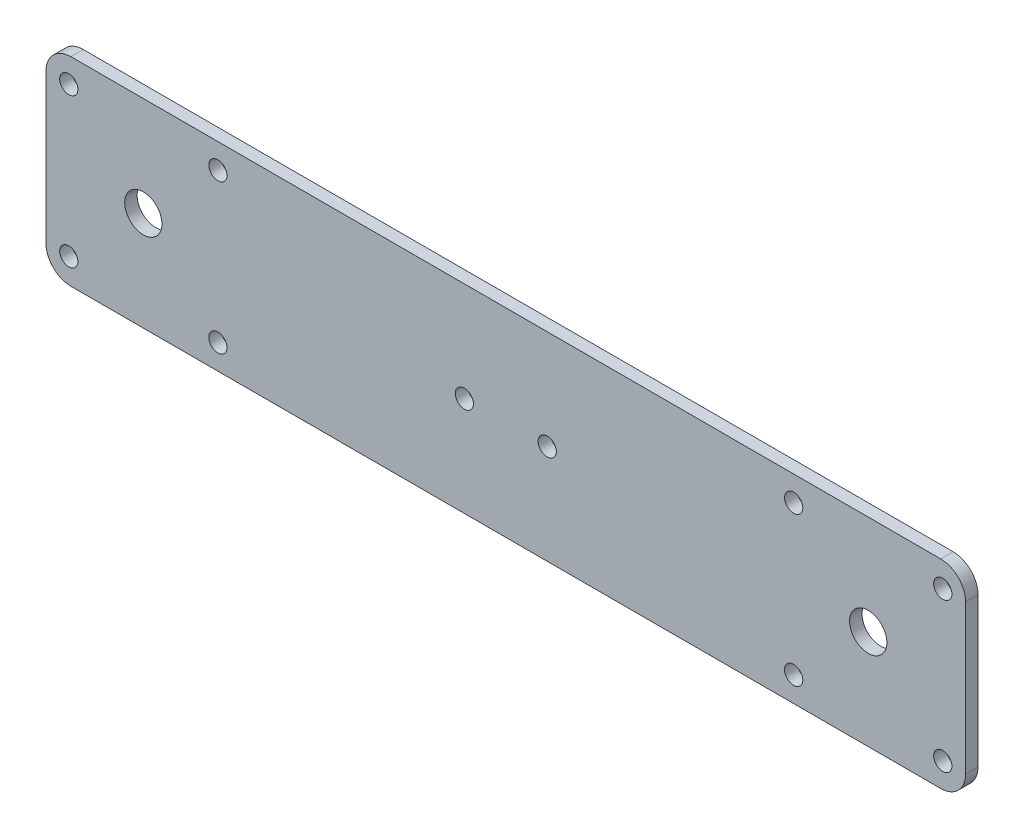
ISO-10303-21;
HEADER;
FILE_DESCRIPTION(('STEP AP214'),'2;1');
FILE_NAME('part.step','',(''),(''),'','','');
FILE_SCHEMA(('AUTOMOTIVE_DESIGN { 1 0 10303 214 1 1 1 1 }'));
ENDSEC;
DATA;
#1=APPLICATION_CONTEXT('core data for automotive mechanical design processes');
#2=APPLICATION_PROTOCOL_DEFINITION('international standard','automotive_design',2000,#1);
#3=PRODUCT_CONTEXT('',#1,'mechanical');
#4=PRODUCT('Part','Part','',(#3));
#5=PRODUCT_RELATED_PRODUCT_CATEGORY('part','',(#4));
#6=PRODUCT_DEFINITION_FORMATION('','',#4);
#7=PRODUCT_DEFINITION_CONTEXT('part definition',#1,'design');
#8=PRODUCT_DEFINITION('design','',#6,#7);
#9=PRODUCT_DEFINITION_SHAPE('','',#8);
#10=(LENGTH_UNIT() NAMED_UNIT(*) SI_UNIT(.MILLI.,.METRE.));
#11=(NAMED_UNIT(*) PLANE_ANGLE_UNIT() SI_UNIT($,.RADIAN.));
#12=(NAMED_UNIT(*) SI_UNIT($,.STERADIAN.) SOLID_ANGLE_UNIT());
#13=UNCERTAINTY_MEASURE_WITH_UNIT(LENGTH_MEASURE(1.E-05),#10,'distance_accuracy_value','');
#14=(GEOMETRIC_REPRESENTATION_CONTEXT(3) GLOBAL_UNCERTAINTY_ASSIGNED_CONTEXT((#13)) GLOBAL_UNIT_ASSIGNED_CONTEXT((#10,
#11,#12)) REPRESENTATION_CONTEXT('',''));
#15=CARTESIAN_POINT('',(0.,0.,0.));
#16=DIRECTION('',(0.,0.,1.));
#17=DIRECTION('',(1.,0.,0.));
#18=AXIS2_PLACEMENT_3D('',#15,#16,#17);
#19=CARTESIAN_POINT('',(0.,0.,3.));
#20=DIRECTION('',(0.,0.,-1.));
#21=DIRECTION('',(-1.,0.,0.));
#22=AXIS2_PLACEMENT_3D('',#19,#20,#21);
#23=PLANE('',#22);
#24=CARTESIAN_POINT('',(288.5,101.,3.));
#25=DIRECTION('',(0.,0.,1.));
#26=DIRECTION('',(-1.,0.,0.));
#27=AXIS2_PLACEMENT_3D('',#24,#25,#26);
#28=CIRCLE('',#27,2.20000000000004);
#29=CARTESIAN_POINT('',(286.3,101.,3.));
#30=VERTEX_POINT('',#29);
#31=EDGE_CURVE('E199',#30,#30,#28,.T.);
#32=ORIENTED_EDGE('',*,*,#31,.F.);
#33=EDGE_LOOP('',(#32));
#34=FACE_BOUND('',#33,.T.);
#35=CARTESIAN_POINT('',(252.5,101.,3.));
#36=DIRECTION('',(0.,0.,1.));
#37=DIRECTION('',(-1.,0.,0.));
#38=AXIS2_PLACEMENT_3D('',#35,#36,#37);
#39=CIRCLE('',#38,2.19999999999998);
#40=CARTESIAN_POINT('',(250.3,101.,3.));
#41=VERTEX_POINT('',#40);
#42=EDGE_CURVE('E561',#41,#41,#39,.T.);
#43=ORIENTED_EDGE('',*,*,#42,.F.);
#44=EDGE_LOOP('',(#43));
#45=FACE_BOUND('',#44,.T.);
#46=CARTESIAN_POINT('',(252.5,65.,3.));
#47=DIRECTION('',(0.,0.,1.));
#48=DIRECTION('',(-1.,0.,0.));
#49=AXIS2_PLACEMENT_3D('',#46,#47,#48);
#50=CIRCLE('',#49,2.19999999999998);
#51=CARTESIAN_POINT('',(250.3,65.,3.));
#52=VERTEX_POINT('',#51);
#53=EDGE_CURVE('E560',#52,#52,#50,.T.);
#54=ORIENTED_EDGE('',*,*,#53,.F.);
#55=EDGE_LOOP('',(#54));
#56=FACE_BOUND('',#55,.T.);
#57=CARTESIAN_POINT('',(288.5,65.,3.));
#58=DIRECTION('',(0.,0.,1.));
#59=DIRECTION('',(-1.,0.,0.));
#60=AXIS2_PLACEMENT_3D('',#57,#58,#59);
#61=CIRCLE('',#60,2.20000000000004);
#62=CARTESIAN_POINT('',(286.3,65.,3.));
#63=VERTEX_POINT('',#62);
#64=EDGE_CURVE('E544',#63,#63,#61,.T.);
#65=ORIENTED_EDGE('',*,*,#64,.F.);
#66=EDGE_LOOP('',(#65));
#67=FACE_BOUND('',#66,.T.);
#68=CARTESIAN_POINT('',(113.5,65.,3.));
#69=DIRECTION('',(0.,0.,1.));
#70=DIRECTION('',(1.,0.,0.));
#71=AXIS2_PLACEMENT_3D('',#68,#69,#70);
#72=CIRCLE('',#71,2.2);
#73=CARTESIAN_POINT('',(115.7,65.,3.));
#74=VERTEX_POINT('',#73);
#75=EDGE_CURVE('E535',#74,#74,#72,.T.);
#76=ORIENTED_EDGE('',*,*,#75,.F.);
#77=EDGE_LOOP('',(#76));
#78=FACE_BOUND('',#77,.T.);
#79=CARTESIAN_POINT('',(77.5,65.,3.));
#80=DIRECTION('',(0.,0.,1.));
#81=DIRECTION('',(1.,0.,0.));
#82=AXIS2_PLACEMENT_3D('',#79,#80,#81);
#83=CIRCLE('',#82,2.2);
#84=CARTESIAN_POINT('',(79.7,65.,3.));
#85=VERTEX_POINT('',#84);
#86=EDGE_CURVE('E534',#85,#85,#83,.T.);
#87=ORIENTED_EDGE('',*,*,#86,.F.);
#88=EDGE_LOOP('',(#87));
#89=FACE_BOUND('',#88,.T.);
#90=CARTESIAN_POINT('',(113.5,101.,3.));
#91=DIRECTION('',(0.,0.,1.));
#92=DIRECTION('',(1.,0.,0.));
#93=AXIS2_PLACEMENT_3D('',#90,#91,#92);
#94=CIRCLE('',#93,2.2);
#95=CARTESIAN_POINT('',(115.7,101.,3.));
#96=VERTEX_POINT('',#95);
#97=EDGE_CURVE('E517',#96,#96,#94,.T.);
#98=ORIENTED_EDGE('',*,*,#97,.F.);
#99=EDGE_LOOP('',(#98));
#100=FACE_BOUND('',#99,.T.);
#101=CARTESIAN_POINT('',(77.5,101.,3.));
#102=DIRECTION('',(0.,0.,1.));
#103=DIRECTION('',(1.,0.,0.));
#104=AXIS2_PLACEMENT_3D('',#101,#102,#103);
#105=CIRCLE('',#104,2.2);
#106=CARTESIAN_POINT('',(79.7,101.,3.));
#107=VERTEX_POINT('',#106);
#108=EDGE_CURVE('E508',#107,#107,#105,.T.);
#109=ORIENTED_EDGE('',*,*,#108,.F.);
#110=EDGE_LOOP('',(#109));
#111=FACE_BOUND('',#110,.T.);
#112=CARTESIAN_POINT('',(95.5,83.,3.));
#113=DIRECTION('',(0.,0.,1.));
#114=DIRECTION('',(-1.,0.,0.));
#115=AXIS2_PLACEMENT_3D('',#112,#113,#114);
#116=CIRCLE('',#115,4.49999999999999);
#117=CARTESIAN_POINT('',(91.,83.,3.));
#118=VERTEX_POINT('',#117);
#119=EDGE_CURVE('E280',#118,#118,#116,.T.);
#120=ORIENTED_EDGE('',*,*,#119,.F.);
#121=EDGE_LOOP('',(#120));
#122=FACE_BOUND('',#121,.T.);
#123=CARTESIAN_POINT('',(270.5,83.,3.));
#124=DIRECTION('',(0.,0.,1.));
#125=DIRECTION('',(1.,0.,0.));
#126=AXIS2_PLACEMENT_3D('',#123,#124,#125);
#127=CIRCLE('',#126,4.50000000000002);
#128=CARTESIAN_POINT('',(275.,83.,3.));
#129=VERTEX_POINT('',#128);
#130=EDGE_CURVE('E269',#129,#129,#127,.T.);
#131=ORIENTED_EDGE('',*,*,#130,.F.);
#132=EDGE_LOOP('',(#131));
#133=FACE_BOUND('',#132,.T.);
#134=CARTESIAN_POINT('',(173.,83.,3.));
#135=DIRECTION('',(0.,0.,1.));
#136=DIRECTION('',(-1.,0.,0.));
#137=AXIS2_PLACEMENT_3D('',#134,#135,#136);
#138=CIRCLE('',#137,2.20000000000001);
#139=CARTESIAN_POINT('',(170.8,83.,3.));
#140=VERTEX_POINT('',#139);
#141=EDGE_CURVE('E281',#140,#140,#138,.T.);
#142=ORIENTED_EDGE('',*,*,#141,.F.);
#143=EDGE_LOOP('',(#142));
#144=FACE_BOUND('',#143,.T.);
#145=CARTESIAN_POINT('',(193.,83.,3.));
#146=DIRECTION('',(0.,0.,1.));
#147=DIRECTION('',(1.,0.,0.));
#148=AXIS2_PLACEMENT_3D('',#145,#146,#147);
#149=CIRCLE('',#148,2.20000000000001);
#150=CARTESIAN_POINT('',(195.2,83.,3.));
#151=VERTEX_POINT('',#150);
#152=EDGE_CURVE('E137',#151,#151,#149,.T.);
#153=ORIENTED_EDGE('',*,*,#152,.F.);
#154=EDGE_LOOP('',(#153));
#155=FACE_BOUND('',#154,.T.);
#156=DIRECTION('',(1.,0.,0.));
#157=VECTOR('',#156,1.);
#158=CARTESIAN_POINT('',(294.,59.0000000000001,3.));
#159=LINE('',#158,#157);
#160=CARTESIAN_POINT('',(78.,59.0000000000001,3.));
#161=VERTEX_POINT('',#160);
#162=CARTESIAN_POINT('',(288.,59.0000000000001,3.));
#163=VERTEX_POINT('',#162);
#164=EDGE_CURVE('E112',#161,#163,#159,.T.);
#165=ORIENTED_EDGE('',*,*,#164,.T.);
#166=CARTESIAN_POINT('',(288.,65.0000000000001,3.));
#167=DIRECTION('',(0.,0.,-1.));
#168=DIRECTION('',(-1.,0.,0.));
#169=AXIS2_PLACEMENT_3D('',#166,#167,#168);
#170=CIRCLE('',#169,6.);
#171=CARTESIAN_POINT('',(294.,65.0000000000001,3.));
#172=VERTEX_POINT('',#171);
#173=EDGE_CURVE('E151',#163,#172,#170,.F.);
#174=ORIENTED_EDGE('',*,*,#173,.T.);
#175=DIRECTION('',(0.,1.,0.));
#176=VECTOR('',#175,1.);
#177=CARTESIAN_POINT('',(294.,107.,3.));
#178=LINE('',#177,#176);
#179=CARTESIAN_POINT('',(294.,101.,3.));
#180=VERTEX_POINT('',#179);
#181=EDGE_CURVE('E131',#172,#180,#178,.T.);
#182=ORIENTED_EDGE('',*,*,#181,.T.);
#183=CARTESIAN_POINT('',(288.,101.,3.));
#184=DIRECTION('',(0.,0.,-1.));
#185=DIRECTION('',(-1.,0.,0.));
#186=AXIS2_PLACEMENT_3D('',#183,#184,#185);
#187=CIRCLE('',#186,6.);
#188=CARTESIAN_POINT('',(288.,107.,3.));
#189=VERTEX_POINT('',#188);
#190=EDGE_CURVE('E119',#180,#189,#187,.F.);
#191=ORIENTED_EDGE('',*,*,#190,.T.);
#192=DIRECTION('',(-1.,0.,0.));
#193=VECTOR('',#192,1.);
#194=CARTESIAN_POINT('',(294.,107.,3.));
#195=LINE('',#194,#193);
#196=CARTESIAN_POINT('',(78.,107.,3.));
#197=VERTEX_POINT('',#196);
#198=EDGE_CURVE('E187',#189,#197,#195,.T.);
#199=ORIENTED_EDGE('',*,*,#198,.T.);
#200=CARTESIAN_POINT('',(78.,101.,3.));
#201=DIRECTION('',(0.,0.,-1.));
#202=DIRECTION('',(-1.,0.,0.));
#203=AXIS2_PLACEMENT_3D('',#200,#201,#202);
#204=CIRCLE('',#203,6.);
#205=CARTESIAN_POINT('',(72.,101.,3.));
#206=VERTEX_POINT('',#205);
#207=EDGE_CURVE('E120',#197,#206,#204,.F.);
#208=ORIENTED_EDGE('',*,*,#207,.T.);
#209=DIRECTION('',(0.,-1.,0.));
#210=VECTOR('',#209,1.);
#211=CARTESIAN_POINT('',(72.,107.,3.));
#212=LINE('',#211,#210);
#213=CARTESIAN_POINT('',(72.,65.0000000000001,3.));
#214=VERTEX_POINT('',#213);
#215=EDGE_CURVE('E114',#206,#214,#212,.T.);
#216=ORIENTED_EDGE('',*,*,#215,.T.);
#217=CARTESIAN_POINT('',(78.,65.0000000000001,3.));
#218=DIRECTION('',(0.,0.,-1.));
#219=DIRECTION('',(-1.,0.,0.));
#220=AXIS2_PLACEMENT_3D('',#217,#218,#219);
#221=CIRCLE('',#220,6.);
#222=EDGE_CURVE('E110',#214,#161,#221,.F.);
#223=ORIENTED_EDGE('',*,*,#222,.T.);
#224=EDGE_LOOP('',(#165,#174,#182,#191,#199,#208,#216,#223));
#225=FACE_BOUND('',#224,.T.);
#226=ADVANCED_FACE('F42',(#34,#45,#56,#67,#78,#89,#100,#111,#122,#133,#144,#155,#225),#23,.F.);
#227=CARTESIAN_POINT('',(0.,0.,0.));
#228=DIRECTION('',(0.,0.,-1.));
#229=DIRECTION('',(-1.,0.,0.));
#230=AXIS2_PLACEMENT_3D('',#227,#228,#229);
#231=PLANE('',#230);
#232=CARTESIAN_POINT('',(288.5,101.,0.));
#233=DIRECTION('',(0.,0.,1.));
#234=DIRECTION('',(-1.,0.,0.));
#235=AXIS2_PLACEMENT_3D('',#232,#233,#234);
#236=CIRCLE('',#235,2.20000000000004);
#237=CARTESIAN_POINT('',(286.3,101.,0.));
#238=VERTEX_POINT('',#237);
#239=EDGE_CURVE('E205',#238,#238,#236,.T.);
#240=ORIENTED_EDGE('',*,*,#239,.T.);
#241=EDGE_LOOP('',(#240));
#242=FACE_BOUND('',#241,.T.);
#243=CARTESIAN_POINT('',(252.5,65.,0.));
#244=DIRECTION('',(0.,0.,1.));
#245=DIRECTION('',(-1.,0.,0.));
#246=AXIS2_PLACEMENT_3D('',#243,#244,#245);
#247=CIRCLE('',#246,2.19999999999998);
#248=CARTESIAN_POINT('',(250.3,65.,0.));
#249=VERTEX_POINT('',#248);
#250=EDGE_CURVE('E557',#249,#249,#247,.T.);
#251=ORIENTED_EDGE('',*,*,#250,.T.);
#252=EDGE_LOOP('',(#251));
#253=FACE_BOUND('',#252,.T.);
#254=CARTESIAN_POINT('',(113.5,65.,0.));
#255=DIRECTION('',(0.,0.,1.));
#256=DIRECTION('',(1.,0.,0.));
#257=AXIS2_PLACEMENT_3D('',#254,#255,#256);
#258=CIRCLE('',#257,2.2);
#259=CARTESIAN_POINT('',(115.7,65.,0.));
#260=VERTEX_POINT('',#259);
#261=EDGE_CURVE('E540',#260,#260,#258,.T.);
#262=ORIENTED_EDGE('',*,*,#261,.T.);
#263=EDGE_LOOP('',(#262));
#264=FACE_BOUND('',#263,.T.);
#265=CARTESIAN_POINT('',(113.5,101.,0.));
#266=DIRECTION('',(0.,0.,1.));
#267=DIRECTION('',(1.,0.,0.));
#268=AXIS2_PLACEMENT_3D('',#265,#266,#267);
#269=CIRCLE('',#268,2.2);
#270=CARTESIAN_POINT('',(115.7,101.,0.));
#271=VERTEX_POINT('',#270);
#272=EDGE_CURVE('E521',#271,#271,#269,.T.);
#273=ORIENTED_EDGE('',*,*,#272,.T.);
#274=EDGE_LOOP('',(#273));
#275=FACE_BOUND('',#274,.T.);
#276=CARTESIAN_POINT('',(95.5,83.,0.));
#277=DIRECTION('',(0.,0.,1.));
#278=DIRECTION('',(-1.,0.,0.));
#279=AXIS2_PLACEMENT_3D('',#276,#277,#278);
#280=CIRCLE('',#279,4.49999999999999);
#281=CARTESIAN_POINT('',(91.,83.,0.));
#282=VERTEX_POINT('',#281);
#283=EDGE_CURVE('E277',#282,#282,#280,.T.);
#284=ORIENTED_EDGE('',*,*,#283,.T.);
#285=EDGE_LOOP('',(#284));
#286=FACE_BOUND('',#285,.T.);
#287=CARTESIAN_POINT('',(173.,83.,0.));
#288=DIRECTION('',(0.,0.,1.));
#289=DIRECTION('',(-1.,0.,0.));
#290=AXIS2_PLACEMENT_3D('',#287,#288,#289);
#291=CIRCLE('',#290,2.20000000000001);
#292=CARTESIAN_POINT('',(170.8,83.,0.));
#293=VERTEX_POINT('',#292);
#294=EDGE_CURVE('E275',#293,#293,#291,.T.);
#295=ORIENTED_EDGE('',*,*,#294,.T.);
#296=EDGE_LOOP('',(#295));
#297=FACE_BOUND('',#296,.T.);
#298=CARTESIAN_POINT('',(193.,83.,0.));
#299=DIRECTION('',(0.,0.,1.));
#300=DIRECTION('',(1.,0.,0.));
#301=AXIS2_PLACEMENT_3D('',#298,#299,#300);
#302=CIRCLE('',#301,2.20000000000001);
#303=CARTESIAN_POINT('',(195.2,83.,0.));
#304=VERTEX_POINT('',#303);
#305=EDGE_CURVE('E143',#304,#304,#302,.T.);
#306=ORIENTED_EDGE('',*,*,#305,.T.);
#307=EDGE_LOOP('',(#306));
#308=FACE_BOUND('',#307,.T.);
#309=CARTESIAN_POINT('',(270.5,83.,0.));
#310=DIRECTION('',(0.,0.,1.));
#311=DIRECTION('',(1.,0.,0.));
#312=AXIS2_PLACEMENT_3D('',#309,#310,#311);
#313=CIRCLE('',#312,4.50000000000002);
#314=CARTESIAN_POINT('',(275.,83.,0.));
#315=VERTEX_POINT('',#314);
#316=EDGE_CURVE('E276',#315,#315,#313,.T.);
#317=ORIENTED_EDGE('',*,*,#316,.T.);
#318=EDGE_LOOP('',(#317));
#319=FACE_BOUND('',#318,.T.);
#320=CARTESIAN_POINT('',(77.5,101.,0.));
#321=DIRECTION('',(0.,0.,1.));
#322=DIRECTION('',(1.,0.,0.));
#323=AXIS2_PLACEMENT_3D('',#320,#321,#322);
#324=CIRCLE('',#323,2.2);
#325=CARTESIAN_POINT('',(79.7,101.,0.));
#326=VERTEX_POINT('',#325);
#327=EDGE_CURVE('E512',#326,#326,#324,.T.);
#328=ORIENTED_EDGE('',*,*,#327,.T.);
#329=EDGE_LOOP('',(#328));
#330=FACE_BOUND('',#329,.T.);
#331=CARTESIAN_POINT('',(77.5,65.,0.));
#332=DIRECTION('',(0.,0.,1.));
#333=DIRECTION('',(1.,0.,0.));
#334=AXIS2_PLACEMENT_3D('',#331,#332,#333);
#335=CIRCLE('',#334,2.2);
#336=CARTESIAN_POINT('',(79.7,65.,0.));
#337=VERTEX_POINT('',#336);
#338=EDGE_CURVE('E531',#337,#337,#335,.T.);
#339=ORIENTED_EDGE('',*,*,#338,.T.);
#340=EDGE_LOOP('',(#339));
#341=FACE_BOUND('',#340,.T.);
#342=CARTESIAN_POINT('',(288.5,65.,0.));
#343=DIRECTION('',(0.,0.,1.));
#344=DIRECTION('',(-1.,0.,0.));
#345=AXIS2_PLACEMENT_3D('',#342,#343,#344);
#346=CIRCLE('',#345,2.20000000000004);
#347=CARTESIAN_POINT('',(286.3,65.,0.));
#348=VERTEX_POINT('',#347);
#349=EDGE_CURVE('E549',#348,#348,#346,.T.);
#350=ORIENTED_EDGE('',*,*,#349,.T.);
#351=EDGE_LOOP('',(#350));
#352=FACE_BOUND('',#351,.T.);
#353=CARTESIAN_POINT('',(252.5,101.,0.));
#354=DIRECTION('',(0.,0.,1.));
#355=DIRECTION('',(-1.,0.,0.));
#356=AXIS2_PLACEMENT_3D('',#353,#354,#355);
#357=CIRCLE('',#356,2.19999999999998);
#358=CARTESIAN_POINT('',(250.3,101.,0.));
#359=VERTEX_POINT('',#358);
#360=EDGE_CURVE('E204',#359,#359,#357,.T.);
#361=ORIENTED_EDGE('',*,*,#360,.T.);
#362=EDGE_LOOP('',(#361));
#363=FACE_BOUND('',#362,.T.);
#364=DIRECTION('',(0.,1.,0.));
#365=VECTOR('',#364,1.);
#366=CARTESIAN_POINT('',(294.,107.,0.));
#367=LINE('',#366,#365);
#368=CARTESIAN_POINT('',(294.,65.0000000000001,0.));
#369=VERTEX_POINT('',#368);
#370=CARTESIAN_POINT('',(294.,101.,0.));
#371=VERTEX_POINT('',#370);
#372=EDGE_CURVE('E626',#369,#371,#367,.T.);
#373=ORIENTED_EDGE('',*,*,#372,.F.);
#374=CARTESIAN_POINT('',(288.,65.0000000000001,0.));
#375=DIRECTION('',(0.,0.,-1.));
#376=DIRECTION('',(-1.,0.,0.));
#377=AXIS2_PLACEMENT_3D('',#374,#375,#376);
#378=CIRCLE('',#377,6.);
#379=CARTESIAN_POINT('',(288.,59.0000000000001,0.));
#380=VERTEX_POINT('',#379);
#381=EDGE_CURVE('E168',#369,#380,#378,.T.);
#382=ORIENTED_EDGE('',*,*,#381,.T.);
#383=DIRECTION('',(1.,0.,0.));
#384=VECTOR('',#383,1.);
#385=CARTESIAN_POINT('',(294.,59.0000000000001,0.));
#386=LINE('',#385,#384);
#387=CARTESIAN_POINT('',(78.,59.0000000000001,0.));
#388=VERTEX_POINT('',#387);
#389=EDGE_CURVE('E186',#388,#380,#386,.T.);
#390=ORIENTED_EDGE('',*,*,#389,.F.);
#391=CARTESIAN_POINT('',(78.,65.0000000000001,0.));
#392=DIRECTION('',(0.,0.,-1.));
#393=DIRECTION('',(-1.,0.,0.));
#394=AXIS2_PLACEMENT_3D('',#391,#392,#393);
#395=CIRCLE('',#394,6.);
#396=CARTESIAN_POINT('',(72.,65.0000000000001,0.));
#397=VERTEX_POINT('',#396);
#398=EDGE_CURVE('E135',#388,#397,#395,.T.);
#399=ORIENTED_EDGE('',*,*,#398,.T.);
#400=DIRECTION('',(0.,-1.,0.));
#401=VECTOR('',#400,1.);
#402=CARTESIAN_POINT('',(72.,107.,0.));
#403=LINE('',#402,#401);
#404=CARTESIAN_POINT('',(72.,101.,0.));
#405=VERTEX_POINT('',#404);
#406=EDGE_CURVE('E181',#405,#397,#403,.T.);
#407=ORIENTED_EDGE('',*,*,#406,.F.);
#408=CARTESIAN_POINT('',(78.,101.,0.));
#409=DIRECTION('',(0.,0.,-1.));
#410=DIRECTION('',(-1.,0.,0.));
#411=AXIS2_PLACEMENT_3D('',#408,#409,#410);
#412=CIRCLE('',#411,6.);
#413=CARTESIAN_POINT('',(78.,107.,0.));
#414=VERTEX_POINT('',#413);
#415=EDGE_CURVE('E58',#405,#414,#412,.T.);
#416=ORIENTED_EDGE('',*,*,#415,.T.);
#417=DIRECTION('',(-1.,0.,0.));
#418=VECTOR('',#417,1.);
#419=CARTESIAN_POINT('',(294.,107.,0.));
#420=LINE('',#419,#418);
#421=CARTESIAN_POINT('',(288.,107.,0.));
#422=VERTEX_POINT('',#421);
#423=EDGE_CURVE('E192',#422,#414,#420,.T.);
#424=ORIENTED_EDGE('',*,*,#423,.F.);
#425=CARTESIAN_POINT('',(288.,101.,0.));
#426=DIRECTION('',(0.,0.,-1.));
#427=DIRECTION('',(-1.,0.,0.));
#428=AXIS2_PLACEMENT_3D('',#425,#426,#427);
#429=CIRCLE('',#428,6.);
#430=EDGE_CURVE('E165',#422,#371,#429,.T.);
#431=ORIENTED_EDGE('',*,*,#430,.T.);
#432=EDGE_LOOP('',(#373,#382,#390,#399,#407,#416,#424,#431));
#433=FACE_BOUND('',#432,.T.);
#434=ADVANCED_FACE('F184',(#242,#253,#264,#275,#286,#297,#308,#319,#330,#341,#352,#363,#433),
#231,.T.);
#435=CARTESIAN_POINT('',(193.,83.,3.));
#436=DIRECTION('',(0.,0.,-1.));
#437=DIRECTION('',(-1.,0.,0.));
#438=AXIS2_PLACEMENT_3D('',#435,#436,#437);
#439=CYLINDRICAL_SURFACE('',#438,2.20000000000001);
#440=ORIENTED_EDGE('',*,*,#152,.T.);
#441=EDGE_LOOP('',(#440));
#442=FACE_BOUND('',#441,.T.);
#443=ORIENTED_EDGE('',*,*,#305,.F.);
#444=EDGE_LOOP('',(#443));
#445=FACE_BOUND('',#444,.T.);
#446=ADVANCED_FACE('F296',(#442,#445),#439,.F.);
#447=CARTESIAN_POINT('',(173.,83.,3.));
#448=DIRECTION('',(0.,0.,-1.));
#449=DIRECTION('',(-1.,0.,0.));
#450=AXIS2_PLACEMENT_3D('',#447,#448,#449);
#451=CYLINDRICAL_SURFACE('',#450,2.20000000000001);
#452=ORIENTED_EDGE('',*,*,#141,.T.);
#453=EDGE_LOOP('',(#452));
#454=FACE_BOUND('',#453,.T.);
#455=ORIENTED_EDGE('',*,*,#294,.F.);
#456=EDGE_LOOP('',(#455));
#457=FACE_BOUND('',#456,.T.);
#458=ADVANCED_FACE('F293',(#454,#457),#451,.F.);
#459=CARTESIAN_POINT('',(270.5,83.,3.));
#460=DIRECTION('',(0.,0.,-1.));
#461=DIRECTION('',(-1.,0.,0.));
#462=AXIS2_PLACEMENT_3D('',#459,#460,#461);
#463=CYLINDRICAL_SURFACE('',#462,4.50000000000002);
#464=ORIENTED_EDGE('',*,*,#130,.T.);
#465=EDGE_LOOP('',(#464));
#466=FACE_BOUND('',#465,.T.);
#467=ORIENTED_EDGE('',*,*,#316,.F.);
#468=EDGE_LOOP('',(#467));
#469=FACE_BOUND('',#468,.T.);
#470=ADVANCED_FACE('F295',(#466,#469),#463,.F.);
#471=CARTESIAN_POINT('',(95.5,83.,3.));
#472=DIRECTION('',(0.,0.,-1.));
#473=DIRECTION('',(-1.,0.,0.));
#474=AXIS2_PLACEMENT_3D('',#471,#472,#473);
#475=CYLINDRICAL_SURFACE('',#474,4.49999999999999);
#476=ORIENTED_EDGE('',*,*,#119,.T.);
#477=EDGE_LOOP('',(#476));
#478=FACE_BOUND('',#477,.T.);
#479=ORIENTED_EDGE('',*,*,#283,.F.);
#480=EDGE_LOOP('',(#479));
#481=FACE_BOUND('',#480,.T.);
#482=ADVANCED_FACE('F303',(#478,#481),#475,.F.);
#483=CARTESIAN_POINT('',(77.5,101.,3.));
#484=DIRECTION('',(0.,0.,-1.));
#485=DIRECTION('',(-1.,0.,0.));
#486=AXIS2_PLACEMENT_3D('',#483,#484,#485);
#487=CYLINDRICAL_SURFACE('',#486,2.2);
#488=ORIENTED_EDGE('',*,*,#108,.T.);
#489=EDGE_LOOP('',(#488));
#490=FACE_BOUND('',#489,.T.);
#491=ORIENTED_EDGE('',*,*,#327,.F.);
#492=EDGE_LOOP('',(#491));
#493=FACE_BOUND('',#492,.T.);
#494=ADVANCED_FACE('F462',(#490,#493),#487,.F.);
#495=CARTESIAN_POINT('',(113.5,101.,3.));
#496=DIRECTION('',(0.,0.,-1.));
#497=DIRECTION('',(-1.,0.,0.));
#498=AXIS2_PLACEMENT_3D('',#495,#496,#497);
#499=CYLINDRICAL_SURFACE('',#498,2.2);
#500=ORIENTED_EDGE('',*,*,#97,.T.);
#501=EDGE_LOOP('',(#500));
#502=FACE_BOUND('',#501,.T.);
#503=ORIENTED_EDGE('',*,*,#272,.F.);
#504=EDGE_LOOP('',(#503));
#505=FACE_BOUND('',#504,.T.);
#506=ADVANCED_FACE('F452',(#502,#505),#499,.F.);
#507=CARTESIAN_POINT('',(77.5,65.,3.));
#508=DIRECTION('',(0.,0.,-1.));
#509=DIRECTION('',(-1.,0.,0.));
#510=AXIS2_PLACEMENT_3D('',#507,#508,#509);
#511=CYLINDRICAL_SURFACE('',#510,2.2);
#512=ORIENTED_EDGE('',*,*,#86,.T.);
#513=EDGE_LOOP('',(#512));
#514=FACE_BOUND('',#513,.T.);
#515=ORIENTED_EDGE('',*,*,#338,.F.);
#516=EDGE_LOOP('',(#515));
#517=FACE_BOUND('',#516,.T.);
#518=ADVANCED_FACE('F442',(#514,#517),#511,.F.);
#519=CARTESIAN_POINT('',(113.5,65.,3.));
#520=DIRECTION('',(0.,0.,-1.));
#521=DIRECTION('',(-1.,0.,0.));
#522=AXIS2_PLACEMENT_3D('',#519,#520,#521);
#523=CYLINDRICAL_SURFACE('',#522,2.2);
#524=ORIENTED_EDGE('',*,*,#75,.T.);
#525=EDGE_LOOP('',(#524));
#526=FACE_BOUND('',#525,.T.);
#527=ORIENTED_EDGE('',*,*,#261,.F.);
#528=EDGE_LOOP('',(#527));
#529=FACE_BOUND('',#528,.T.);
#530=ADVANCED_FACE('F432',(#526,#529),#523,.F.);
#531=CARTESIAN_POINT('',(288.5,65.,3.));
#532=DIRECTION('',(0.,0.,-1.));
#533=DIRECTION('',(-1.,0.,0.));
#534=AXIS2_PLACEMENT_3D('',#531,#532,#533);
#535=CYLINDRICAL_SURFACE('',#534,2.20000000000004);
#536=ORIENTED_EDGE('',*,*,#64,.T.);
#537=EDGE_LOOP('',(#536));
#538=FACE_BOUND('',#537,.T.);
#539=ORIENTED_EDGE('',*,*,#349,.F.);
#540=EDGE_LOOP('',(#539));
#541=FACE_BOUND('',#540,.T.);
#542=ADVANCED_FACE('F422',(#538,#541),#535,.F.);
#543=CARTESIAN_POINT('',(252.5,65.,3.));
#544=DIRECTION('',(0.,0.,-1.));
#545=DIRECTION('',(-1.,0.,0.));
#546=AXIS2_PLACEMENT_3D('',#543,#544,#545);
#547=CYLINDRICAL_SURFACE('',#546,2.19999999999998);
#548=ORIENTED_EDGE('',*,*,#53,.T.);
#549=EDGE_LOOP('',(#548));
#550=FACE_BOUND('',#549,.T.);
#551=ORIENTED_EDGE('',*,*,#250,.F.);
#552=EDGE_LOOP('',(#551));
#553=FACE_BOUND('',#552,.T.);
#554=ADVANCED_FACE('F412',(#550,#553),#547,.F.);
#555=CARTESIAN_POINT('',(252.5,101.,3.));
#556=DIRECTION('',(0.,0.,-1.));
#557=DIRECTION('',(-1.,0.,0.));
#558=AXIS2_PLACEMENT_3D('',#555,#556,#557);
#559=CYLINDRICAL_SURFACE('',#558,2.19999999999998);
#560=ORIENTED_EDGE('',*,*,#42,.T.);
#561=EDGE_LOOP('',(#560));
#562=FACE_BOUND('',#561,.T.);
#563=ORIENTED_EDGE('',*,*,#360,.F.);
#564=EDGE_LOOP('',(#563));
#565=FACE_BOUND('',#564,.T.);
#566=ADVANCED_FACE('F402',(#562,#565),#559,.F.);
#567=CARTESIAN_POINT('',(288.5,101.,3.));
#568=DIRECTION('',(0.,0.,-1.));
#569=DIRECTION('',(-1.,0.,0.));
#570=AXIS2_PLACEMENT_3D('',#567,#568,#569);
#571=CYLINDRICAL_SURFACE('',#570,2.20000000000004);
#572=ORIENTED_EDGE('',*,*,#31,.T.);
#573=EDGE_LOOP('',(#572));
#574=FACE_BOUND('',#573,.T.);
#575=ORIENTED_EDGE('',*,*,#239,.F.);
#576=EDGE_LOOP('',(#575));
#577=FACE_BOUND('',#576,.T.);
#578=ADVANCED_FACE('F383',(#574,#577),#571,.F.);
#579=CARTESIAN_POINT('',(72.,107.,0.));
#580=DIRECTION('',(-1.,0.,0.));
#581=DIRECTION('',(0.,0.,1.));
#582=AXIS2_PLACEMENT_3D('',#579,#580,#581);
#583=PLANE('',#582);
#584=ORIENTED_EDGE('',*,*,#406,.T.);
#585=DIRECTION('',(0.,0.,1.));
#586=VECTOR('',#585,1.);
#587=CARTESIAN_POINT('',(72.,65.0000000000001,0.));
#588=LINE('',#587,#586);
#589=EDGE_CURVE('E13',#397,#214,#588,.T.);
#590=ORIENTED_EDGE('',*,*,#589,.T.);
#591=ORIENTED_EDGE('',*,*,#215,.F.);
#592=DIRECTION('',(0.,0.,1.));
#593=VECTOR('',#592,1.);
#594=CARTESIAN_POINT('',(72.,101.,0.));
#595=LINE('',#594,#593);
#596=EDGE_CURVE('E51',#206,#405,#595,.F.);
#597=ORIENTED_EDGE('',*,*,#596,.T.);
#598=EDGE_LOOP('',(#584,#590,#591,#597));
#599=FACE_BOUND('',#598,.T.);
#600=ADVANCED_FACE('F180',(#599),#583,.T.);
#601=CARTESIAN_POINT('',(294.,107.,0.));
#602=DIRECTION('',(0.,1.,0.));
#603=DIRECTION('',(-1.,0.,0.));
#604=AXIS2_PLACEMENT_3D('',#601,#602,#603);
#605=PLANE('',#604);
#606=ORIENTED_EDGE('',*,*,#198,.F.);
#607=DIRECTION('',(0.,0.,1.));
#608=VECTOR('',#607,1.);
#609=CARTESIAN_POINT('',(288.,107.,0.));
#610=LINE('',#609,#608);
#611=EDGE_CURVE('E65',#189,#422,#610,.F.);
#612=ORIENTED_EDGE('',*,*,#611,.T.);
#613=ORIENTED_EDGE('',*,*,#423,.T.);
#614=DIRECTION('',(0.,0.,1.));
#615=VECTOR('',#614,1.);
#616=CARTESIAN_POINT('',(78.,107.,0.));
#617=LINE('',#616,#615);
#618=EDGE_CURVE('E171',#414,#197,#617,.T.);
#619=ORIENTED_EDGE('',*,*,#618,.T.);
#620=EDGE_LOOP('',(#606,#612,#613,#619));
#621=FACE_BOUND('',#620,.T.);
#622=ADVANCED_FACE('F191',(#621),#605,.T.);
#623=CARTESIAN_POINT('',(294.,107.,0.));
#624=DIRECTION('',(1.,0.,0.));
#625=DIRECTION('',(0.,0.,-1.));
#626=AXIS2_PLACEMENT_3D('',#623,#624,#625);
#627=PLANE('',#626);
#628=ORIENTED_EDGE('',*,*,#181,.F.);
#629=DIRECTION('',(0.,0.,1.));
#630=VECTOR('',#629,1.);
#631=CARTESIAN_POINT('',(294.,65.0000000000001,0.));
#632=LINE('',#631,#630);
#633=EDGE_CURVE('E158',#172,#369,#632,.F.);
#634=ORIENTED_EDGE('',*,*,#633,.T.);
#635=ORIENTED_EDGE('',*,*,#372,.T.);
#636=DIRECTION('',(0.,0.,1.));
#637=VECTOR('',#636,1.);
#638=CARTESIAN_POINT('',(294.,101.,0.));
#639=LINE('',#638,#637);
#640=EDGE_CURVE('E154',#371,#180,#639,.T.);
#641=ORIENTED_EDGE('',*,*,#640,.T.);
#642=EDGE_LOOP('',(#628,#634,#635,#641));
#643=FACE_BOUND('',#642,.T.);
#644=ADVANCED_FACE('F357',(#643),#627,.T.);
#645=CARTESIAN_POINT('',(294.,59.0000000000001,0.));
#646=DIRECTION('',(0.,-1.,0.));
#647=DIRECTION('',(1.,0.,0.));
#648=AXIS2_PLACEMENT_3D('',#645,#646,#647);
#649=PLANE('',#648);
#650=ORIENTED_EDGE('',*,*,#389,.T.);
#651=DIRECTION('',(0.,0.,1.));
#652=VECTOR('',#651,1.);
#653=CARTESIAN_POINT('',(288.,59.0000000000001,0.));
#654=LINE('',#653,#652);
#655=EDGE_CURVE('E129',#380,#163,#654,.T.);
#656=ORIENTED_EDGE('',*,*,#655,.T.);
#657=ORIENTED_EDGE('',*,*,#164,.F.);
#658=DIRECTION('',(0.,0.,1.));
#659=VECTOR('',#658,1.);
#660=CARTESIAN_POINT('',(78.,59.0000000000001,0.));
#661=LINE('',#660,#659);
#662=EDGE_CURVE('E126',#161,#388,#661,.F.);
#663=ORIENTED_EDGE('',*,*,#662,.T.);
#664=EDGE_LOOP('',(#650,#656,#657,#663));
#665=FACE_BOUND('',#664,.T.);
#666=ADVANCED_FACE('F125',(#665),#649,.T.);
#667=CARTESIAN_POINT('',(288.,65.0000000000001,0.));
#668=DIRECTION('',(0.,0.,1.));
#669=DIRECTION('',(1.,0.,0.));
#670=AXIS2_PLACEMENT_3D('',#667,#668,#669);
#671=CYLINDRICAL_SURFACE('',#670,6.);
#672=ORIENTED_EDGE('',*,*,#381,.F.);
#673=ORIENTED_EDGE('',*,*,#633,.F.);
#674=ORIENTED_EDGE('',*,*,#173,.F.);
#675=ORIENTED_EDGE('',*,*,#655,.F.);
#676=EDGE_LOOP('',(#672,#673,#674,#675));
#677=FACE_BOUND('',#676,.T.);
#678=ADVANCED_FACE('F319',(#677),#671,.T.);
#679=CARTESIAN_POINT('',(288.,101.,0.));
#680=DIRECTION('',(0.,0.,1.));
#681=DIRECTION('',(1.,0.,0.));
#682=AXIS2_PLACEMENT_3D('',#679,#680,#681);
#683=CYLINDRICAL_SURFACE('',#682,6.);
#684=ORIENTED_EDGE('',*,*,#430,.F.);
#685=ORIENTED_EDGE('',*,*,#611,.F.);
#686=ORIENTED_EDGE('',*,*,#190,.F.);
#687=ORIENTED_EDGE('',*,*,#640,.F.);
#688=EDGE_LOOP('',(#684,#685,#686,#687));
#689=FACE_BOUND('',#688,.T.);
#690=ADVANCED_FACE('F322',(#689),#683,.T.);
#691=CARTESIAN_POINT('',(78.,65.0000000000001,0.));
#692=DIRECTION('',(0.,0.,1.));
#693=DIRECTION('',(1.,0.,0.));
#694=AXIS2_PLACEMENT_3D('',#691,#692,#693);
#695=CYLINDRICAL_SURFACE('',#694,6.);
#696=ORIENTED_EDGE('',*,*,#398,.F.);
#697=ORIENTED_EDGE('',*,*,#662,.F.);
#698=ORIENTED_EDGE('',*,*,#222,.F.);
#699=ORIENTED_EDGE('',*,*,#589,.F.);
#700=EDGE_LOOP('',(#696,#697,#698,#699));
#701=FACE_BOUND('',#700,.T.);
#702=ADVANCED_FACE('F134',(#701),#695,.T.);
#703=CARTESIAN_POINT('',(78.,101.,0.));
#704=DIRECTION('',(0.,0.,1.));
#705=DIRECTION('',(1.,0.,0.));
#706=AXIS2_PLACEMENT_3D('',#703,#704,#705);
#707=CYLINDRICAL_SURFACE('',#706,6.);
#708=ORIENTED_EDGE('',*,*,#415,.F.);
#709=ORIENTED_EDGE('',*,*,#596,.F.);
#710=ORIENTED_EDGE('',*,*,#207,.F.);
#711=ORIENTED_EDGE('',*,*,#618,.F.);
#712=EDGE_LOOP('',(#708,#709,#710,#711));
#713=FACE_BOUND('',#712,.T.);
#714=ADVANCED_FACE('F44',(#713),#707,.T.);
#715=CLOSED_SHELL('',(#226,#434,#446,#458,#470,#482,#494,#506,#518,#530,#542,#554,#566,#578,
#600,#622,#644,#666,#678,#690,#702,#714));
#716=MANIFOLD_SOLID_BREP('B2',#715);
#717=ADVANCED_BREP_SHAPE_REPRESENTATION('',(#18,#716),#14);
#718=SHAPE_DEFINITION_REPRESENTATION(#9,#717);
ENDSEC;
END-ISO-10303-21;
